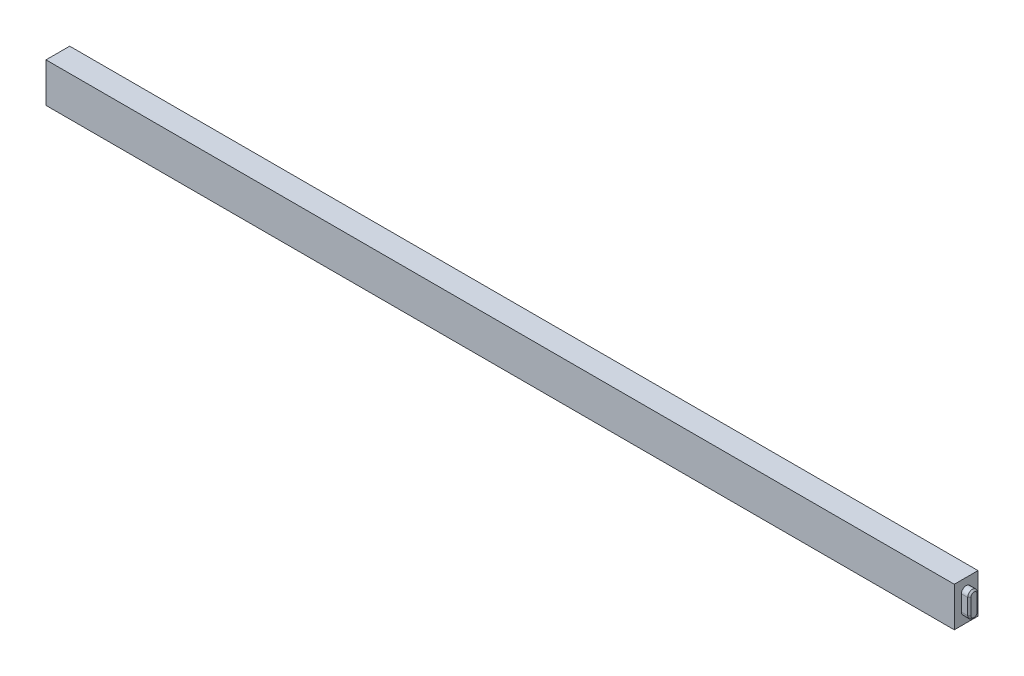
ISO-10303-21;
HEADER;
FILE_DESCRIPTION(('STEP AP214'),'2;1');
FILE_NAME('part.step','',(''),(''),'','','');
FILE_SCHEMA(('AUTOMOTIVE_DESIGN { 1 0 10303 214 1 1 1 1 }'));
ENDSEC;
DATA;
#1=APPLICATION_CONTEXT('core data for automotive mechanical design processes');
#2=APPLICATION_PROTOCOL_DEFINITION('international standard','automotive_design',2000,#1);
#3=PRODUCT_CONTEXT('',#1,'mechanical');
#4=PRODUCT('Part','Part','',(#3));
#5=PRODUCT_RELATED_PRODUCT_CATEGORY('part','',(#4));
#6=PRODUCT_DEFINITION_FORMATION('','',#4);
#7=PRODUCT_DEFINITION_CONTEXT('part definition',#1,'design');
#8=PRODUCT_DEFINITION('design','',#6,#7);
#9=PRODUCT_DEFINITION_SHAPE('','',#8);
#10=(LENGTH_UNIT() NAMED_UNIT(*) SI_UNIT(.MILLI.,.METRE.));
#11=(NAMED_UNIT(*) PLANE_ANGLE_UNIT() SI_UNIT($,.RADIAN.));
#12=(NAMED_UNIT(*) SI_UNIT($,.STERADIAN.) SOLID_ANGLE_UNIT());
#13=UNCERTAINTY_MEASURE_WITH_UNIT(LENGTH_MEASURE(1.E-05),#10,'distance_accuracy_value','');
#14=(GEOMETRIC_REPRESENTATION_CONTEXT(3) GLOBAL_UNCERTAINTY_ASSIGNED_CONTEXT((#13)) GLOBAL_UNIT_ASSIGNED_CONTEXT((#10,
#11,#12)) REPRESENTATION_CONTEXT('',''));
#15=CARTESIAN_POINT('',(0.,0.,0.));
#16=DIRECTION('',(0.,0.,1.));
#17=DIRECTION('',(1.,0.,0.));
#18=AXIS2_PLACEMENT_3D('',#15,#16,#17);
#19=CARTESIAN_POINT('',(-575.,25.,30.));
#20=DIRECTION('',(1.,0.,0.));
#21=DIRECTION('',(0.,1.,0.));
#22=AXIS2_PLACEMENT_3D('',#19,#20,#21);
#23=PLANE('',#22);
#24=DIRECTION('',(0.,-1.,0.));
#25=VECTOR('',#24,1.);
#26=CARTESIAN_POINT('',(-575.,25.,0.));
#27=LINE('',#26,#25);
#28=CARTESIAN_POINT('',(-575.,25.,0.));
#29=VERTEX_POINT('',#28);
#30=CARTESIAN_POINT('',(-575.,-25.,0.));
#31=VERTEX_POINT('',#30);
#32=EDGE_CURVE('E219',#29,#31,#27,.T.);
#33=ORIENTED_EDGE('',*,*,#32,.T.);
#34=DIRECTION('',(0.,0.,-1.));
#35=VECTOR('',#34,1.);
#36=CARTESIAN_POINT('',(-575.,-25.,30.));
#37=LINE('',#36,#35);
#38=CARTESIAN_POINT('',(-575.,-25.,30.));
#39=VERTEX_POINT('',#38);
#40=EDGE_CURVE('E224',#39,#31,#37,.T.);
#41=ORIENTED_EDGE('',*,*,#40,.F.);
#42=DIRECTION('',(0.,-1.,0.));
#43=VECTOR('',#42,1.);
#44=CARTESIAN_POINT('',(-575.,25.,30.));
#45=LINE('',#44,#43);
#46=CARTESIAN_POINT('',(-575.,25.,30.));
#47=VERTEX_POINT('',#46);
#48=EDGE_CURVE('E210',#47,#39,#45,.T.);
#49=ORIENTED_EDGE('',*,*,#48,.F.);
#50=DIRECTION('',(0.,0.,-1.));
#51=VECTOR('',#50,1.);
#52=CARTESIAN_POINT('',(-575.,25.,30.));
#53=LINE('',#52,#51);
#54=EDGE_CURVE('E227',#47,#29,#53,.T.);
#55=ORIENTED_EDGE('',*,*,#54,.T.);
#56=EDGE_LOOP('',(#33,#41,#49,#55));
#57=FACE_BOUND('',#56,.T.);
#58=CARTESIAN_POINT('',(-575.,9.99999999999997,15.));
#59=DIRECTION('',(-1.,0.,0.));
#60=DIRECTION('',(0.,-1.,0.));
#61=AXIS2_PLACEMENT_3D('',#58,#59,#60);
#62=CIRCLE('',#61,6.);
#63=CARTESIAN_POINT('',(-575.,9.99999999999997,21.));
#64=VERTEX_POINT('',#63);
#65=CARTESIAN_POINT('',(-575.,9.99999999999997,9.));
#66=VERTEX_POINT('',#65);
#67=EDGE_CURVE('E172',#64,#66,#62,.T.);
#68=ORIENTED_EDGE('',*,*,#67,.F.);
#69=DIRECTION('',(0.,-1.,0.));
#70=VECTOR('',#69,1.);
#71=CARTESIAN_POINT('',(-575.,9.99999999999997,21.));
#72=LINE('',#71,#70);
#73=CARTESIAN_POINT('',(-575.,-10.,21.));
#74=VERTEX_POINT('',#73);
#75=EDGE_CURVE('E169',#64,#74,#72,.T.);
#76=ORIENTED_EDGE('',*,*,#75,.T.);
#77=CARTESIAN_POINT('',(-575.,-10.,15.));
#78=DIRECTION('',(-1.,0.,0.));
#79=DIRECTION('',(0.,-1.,0.));
#80=AXIS2_PLACEMENT_3D('',#77,#78,#79);
#81=CIRCLE('',#80,6.);
#82=CARTESIAN_POINT('',(-575.,-10.,9.00000000000001));
#83=VERTEX_POINT('',#82);
#84=EDGE_CURVE('E157',#83,#74,#81,.T.);
#85=ORIENTED_EDGE('',*,*,#84,.F.);
#86=DIRECTION('',(0.,-1.,0.));
#87=VECTOR('',#86,1.);
#88=CARTESIAN_POINT('',(-575.,9.99999999999997,9.));
#89=LINE('',#88,#87);
#90=EDGE_CURVE('E166',#66,#83,#89,.T.);
#91=ORIENTED_EDGE('',*,*,#90,.F.);
#92=EDGE_LOOP('',(#68,#76,#85,#91));
#93=FACE_BOUND('',#92,.T.);
#94=ADVANCED_FACE('F41',(#57,#93),#23,.F.);
#95=CARTESIAN_POINT('',(575.,25.,30.));
#96=DIRECTION('',(-1.,0.,0.));
#97=DIRECTION('',(0.,-1.,0.));
#98=AXIS2_PLACEMENT_3D('',#95,#96,#97);
#99=PLANE('',#98);
#100=DIRECTION('',(0.,1.,0.));
#101=VECTOR('',#100,1.);
#102=CARTESIAN_POINT('',(575.,25.,0.));
#103=LINE('',#102,#101);
#104=CARTESIAN_POINT('',(575.,-25.,0.));
#105=VERTEX_POINT('',#104);
#106=CARTESIAN_POINT('',(575.,25.,0.));
#107=VERTEX_POINT('',#106);
#108=EDGE_CURVE('E203',#105,#107,#103,.T.);
#109=ORIENTED_EDGE('',*,*,#108,.T.);
#110=DIRECTION('',(0.,0.,-1.));
#111=VECTOR('',#110,1.);
#112=CARTESIAN_POINT('',(575.,25.,30.));
#113=LINE('',#112,#111);
#114=CARTESIAN_POINT('',(575.,25.,30.));
#115=VERTEX_POINT('',#114);
#116=EDGE_CURVE('E230',#115,#107,#113,.T.);
#117=ORIENTED_EDGE('',*,*,#116,.F.);
#118=DIRECTION('',(0.,1.,0.));
#119=VECTOR('',#118,1.);
#120=CARTESIAN_POINT('',(575.,25.,30.));
#121=LINE('',#120,#119);
#122=CARTESIAN_POINT('',(575.,-25.,30.));
#123=VERTEX_POINT('',#122);
#124=EDGE_CURVE('E204',#123,#115,#121,.T.);
#125=ORIENTED_EDGE('',*,*,#124,.F.);
#126=DIRECTION('',(0.,0.,-1.));
#127=VECTOR('',#126,1.);
#128=CARTESIAN_POINT('',(575.,-25.,30.));
#129=LINE('',#128,#127);
#130=EDGE_CURVE('E214',#123,#105,#129,.T.);
#131=ORIENTED_EDGE('',*,*,#130,.T.);
#132=EDGE_LOOP('',(#109,#117,#125,#131));
#133=FACE_BOUND('',#132,.T.);
#134=CARTESIAN_POINT('',(575.,10.,15.));
#135=DIRECTION('',(1.,0.,0.));
#136=DIRECTION('',(0.,0.,-1.));
#137=AXIS2_PLACEMENT_3D('',#134,#135,#136);
#138=CIRCLE('',#137,5.99999999999999);
#139=CARTESIAN_POINT('',(575.,10.,9.00000000000001));
#140=VERTEX_POINT('',#139);
#141=CARTESIAN_POINT('',(575.,10.,21.));
#142=VERTEX_POINT('',#141);
#143=EDGE_CURVE('E182',#140,#142,#138,.T.);
#144=ORIENTED_EDGE('',*,*,#143,.F.);
#145=DIRECTION('',(0.,1.,0.));
#146=VECTOR('',#145,1.);
#147=CARTESIAN_POINT('',(575.,10.,9.00000000000001));
#148=LINE('',#147,#146);
#149=CARTESIAN_POINT('',(575.,-10.,9.));
#150=VERTEX_POINT('',#149);
#151=EDGE_CURVE('E192',#150,#140,#148,.T.);
#152=ORIENTED_EDGE('',*,*,#151,.F.);
#153=CARTESIAN_POINT('',(575.,-10.,15.));
#154=DIRECTION('',(1.,0.,0.));
#155=DIRECTION('',(0.,0.,-1.));
#156=AXIS2_PLACEMENT_3D('',#153,#154,#155);
#157=CIRCLE('',#156,5.99999999999999);
#158=CARTESIAN_POINT('',(575.,-10.,21.));
#159=VERTEX_POINT('',#158);
#160=EDGE_CURVE('E189',#159,#150,#157,.T.);
#161=ORIENTED_EDGE('',*,*,#160,.F.);
#162=DIRECTION('',(0.,-1.,0.));
#163=VECTOR('',#162,1.);
#164=CARTESIAN_POINT('',(575.,10.,21.));
#165=LINE('',#164,#163);
#166=EDGE_CURVE('E185',#142,#159,#165,.T.);
#167=ORIENTED_EDGE('',*,*,#166,.F.);
#168=EDGE_LOOP('',(#144,#152,#161,#167));
#169=FACE_BOUND('',#168,.T.);
#170=ADVANCED_FACE('F316',(#133,#169),#99,.F.);
#171=CARTESIAN_POINT('',(-575.,25.,30.));
#172=DIRECTION('',(0.,-1.,0.));
#173=DIRECTION('',(0.,0.,-1.));
#174=AXIS2_PLACEMENT_3D('',#171,#172,#173);
#175=PLANE('',#174);
#176=DIRECTION('',(-1.,0.,0.));
#177=VECTOR('',#176,1.);
#178=CARTESIAN_POINT('',(-575.,25.,0.));
#179=LINE('',#178,#177);
#180=EDGE_CURVE('E217',#107,#29,#179,.T.);
#181=ORIENTED_EDGE('',*,*,#180,.T.);
#182=ORIENTED_EDGE('',*,*,#54,.F.);
#183=DIRECTION('',(-1.,0.,0.));
#184=VECTOR('',#183,1.);
#185=CARTESIAN_POINT('',(-575.,25.,30.));
#186=LINE('',#185,#184);
#187=EDGE_CURVE('E207',#115,#47,#186,.T.);
#188=ORIENTED_EDGE('',*,*,#187,.F.);
#189=ORIENTED_EDGE('',*,*,#116,.T.);
#190=EDGE_LOOP('',(#181,#182,#188,#189));
#191=FACE_BOUND('',#190,.T.);
#192=ADVANCED_FACE('F322',(#191),#175,.F.);
#193=CARTESIAN_POINT('',(-575.,-25.,30.));
#194=DIRECTION('',(0.,1.,0.));
#195=DIRECTION('',(0.,0.,1.));
#196=AXIS2_PLACEMENT_3D('',#193,#194,#195);
#197=PLANE('',#196);
#198=DIRECTION('',(1.,0.,0.));
#199=VECTOR('',#198,1.);
#200=CARTESIAN_POINT('',(-575.,-25.,0.));
#201=LINE('',#200,#199);
#202=EDGE_CURVE('E208',#31,#105,#201,.T.);
#203=ORIENTED_EDGE('',*,*,#202,.T.);
#204=ORIENTED_EDGE('',*,*,#130,.F.);
#205=DIRECTION('',(1.,0.,0.));
#206=VECTOR('',#205,1.);
#207=CARTESIAN_POINT('',(-575.,-25.,30.));
#208=LINE('',#207,#206);
#209=EDGE_CURVE('E212',#39,#123,#208,.T.);
#210=ORIENTED_EDGE('',*,*,#209,.F.);
#211=ORIENTED_EDGE('',*,*,#40,.T.);
#212=EDGE_LOOP('',(#203,#204,#210,#211));
#213=FACE_BOUND('',#212,.T.);
#214=ADVANCED_FACE('F327',(#213),#197,.F.);
#215=CARTESIAN_POINT('',(0.,0.,30.));
#216=DIRECTION('',(0.,0.,1.));
#217=DIRECTION('',(1.,0.,0.));
#218=AXIS2_PLACEMENT_3D('',#215,#216,#217);
#219=PLANE('',#218);
#220=ORIENTED_EDGE('',*,*,#124,.T.);
#221=ORIENTED_EDGE('',*,*,#187,.T.);
#222=ORIENTED_EDGE('',*,*,#48,.T.);
#223=ORIENTED_EDGE('',*,*,#209,.T.);
#224=EDGE_LOOP('',(#220,#221,#222,#223));
#225=FACE_BOUND('',#224,.T.);
#226=ADVANCED_FACE('F476',(#225),#219,.T.);
#227=CARTESIAN_POINT('',(0.,0.,0.));
#228=DIRECTION('',(0.,0.,1.));
#229=DIRECTION('',(1.,0.,0.));
#230=AXIS2_PLACEMENT_3D('',#227,#228,#229);
#231=PLANE('',#230);
#232=ORIENTED_EDGE('',*,*,#108,.F.);
#233=ORIENTED_EDGE('',*,*,#202,.F.);
#234=ORIENTED_EDGE('',*,*,#32,.F.);
#235=ORIENTED_EDGE('',*,*,#180,.F.);
#236=EDGE_LOOP('',(#232,#233,#234,#235));
#237=FACE_BOUND('',#236,.T.);
#238=ADVANCED_FACE('F464',(#237),#231,.F.);
#239=CARTESIAN_POINT('',(585.,10.,15.));
#240=DIRECTION('',(-1.,0.,0.));
#241=DIRECTION('',(0.,0.,1.));
#242=AXIS2_PLACEMENT_3D('',#239,#240,#241);
#243=CYLINDRICAL_SURFACE('',#242,5.99999999999999);
#244=DIRECTION('',(-1.,0.,0.));
#245=VECTOR('',#244,1.);
#246=CARTESIAN_POINT('',(585.,10.,21.));
#247=LINE('',#246,#245);
#248=CARTESIAN_POINT('',(583.,10.,21.));
#249=VERTEX_POINT('',#248);
#250=EDGE_CURVE('E201',#249,#142,#247,.T.);
#251=ORIENTED_EDGE('',*,*,#250,.F.);
#252=CARTESIAN_POINT('',(583.,10.,15.));
#253=DIRECTION('',(1.,0.,0.));
#254=DIRECTION('',(0.,0.,-1.));
#255=AXIS2_PLACEMENT_3D('',#252,#253,#254);
#256=CIRCLE('',#255,5.99999999999999);
#257=CARTESIAN_POINT('',(583.,10.,9.00000000000001));
#258=VERTEX_POINT('',#257);
#259=EDGE_CURVE('E249',#249,#258,#256,.F.);
#260=ORIENTED_EDGE('',*,*,#259,.T.);
#261=DIRECTION('',(-1.,0.,0.));
#262=VECTOR('',#261,1.);
#263=CARTESIAN_POINT('',(585.,10.,9.00000000000001));
#264=LINE('',#263,#262);
#265=EDGE_CURVE('E195',#258,#140,#264,.T.);
#266=ORIENTED_EDGE('',*,*,#265,.T.);
#267=ORIENTED_EDGE('',*,*,#143,.T.);
#268=EDGE_LOOP('',(#251,#260,#266,#267));
#269=FACE_BOUND('',#268,.T.);
#270=ADVANCED_FACE('F456',(#269),#243,.T.);
#271=CARTESIAN_POINT('',(585.,10.,21.));
#272=DIRECTION('',(0.,0.,-1.));
#273=DIRECTION('',(0.,1.,0.));
#274=AXIS2_PLACEMENT_3D('',#271,#272,#273);
#275=PLANE('',#274);
#276=DIRECTION('',(-1.,0.,0.));
#277=VECTOR('',#276,1.);
#278=CARTESIAN_POINT('',(585.,-10.,21.));
#279=LINE('',#278,#277);
#280=CARTESIAN_POINT('',(583.,-10.,21.));
#281=VERTEX_POINT('',#280);
#282=EDGE_CURVE('E199',#281,#159,#279,.T.);
#283=ORIENTED_EDGE('',*,*,#282,.F.);
#284=DIRECTION('',(0.,1.,0.));
#285=VECTOR('',#284,1.);
#286=CARTESIAN_POINT('',(583.,10.,21.));
#287=LINE('',#286,#285);
#288=EDGE_CURVE('E247',#281,#249,#287,.T.);
#289=ORIENTED_EDGE('',*,*,#288,.T.);
#290=ORIENTED_EDGE('',*,*,#250,.T.);
#291=ORIENTED_EDGE('',*,*,#166,.T.);
#292=EDGE_LOOP('',(#283,#289,#290,#291));
#293=FACE_BOUND('',#292,.T.);
#294=ADVANCED_FACE('F448',(#293),#275,.F.);
#295=CARTESIAN_POINT('',(585.,-10.,15.));
#296=DIRECTION('',(-1.,0.,0.));
#297=DIRECTION('',(0.,0.,1.));
#298=AXIS2_PLACEMENT_3D('',#295,#296,#297);
#299=CYLINDRICAL_SURFACE('',#298,5.99999999999999);
#300=DIRECTION('',(-1.,0.,0.));
#301=VECTOR('',#300,1.);
#302=CARTESIAN_POINT('',(585.,-10.,9.));
#303=LINE('',#302,#301);
#304=CARTESIAN_POINT('',(583.,-10.,9.));
#305=VERTEX_POINT('',#304);
#306=EDGE_CURVE('E197',#305,#150,#303,.T.);
#307=ORIENTED_EDGE('',*,*,#306,.F.);
#308=CARTESIAN_POINT('',(583.,-10.,15.));
#309=DIRECTION('',(1.,0.,0.));
#310=DIRECTION('',(0.,0.,-1.));
#311=AXIS2_PLACEMENT_3D('',#308,#309,#310);
#312=CIRCLE('',#311,5.99999999999999);
#313=EDGE_CURVE('E245',#305,#281,#312,.F.);
#314=ORIENTED_EDGE('',*,*,#313,.T.);
#315=ORIENTED_EDGE('',*,*,#282,.T.);
#316=ORIENTED_EDGE('',*,*,#160,.T.);
#317=EDGE_LOOP('',(#307,#314,#315,#316));
#318=FACE_BOUND('',#317,.T.);
#319=ADVANCED_FACE('F440',(#318),#299,.T.);
#320=CARTESIAN_POINT('',(585.,10.,9.00000000000001));
#321=DIRECTION('',(0.,0.,1.));
#322=DIRECTION('',(0.,-1.,0.));
#323=AXIS2_PLACEMENT_3D('',#320,#321,#322);
#324=PLANE('',#323);
#325=ORIENTED_EDGE('',*,*,#265,.F.);
#326=DIRECTION('',(0.,-1.,0.));
#327=VECTOR('',#326,1.);
#328=CARTESIAN_POINT('',(583.,-10.,9.));
#329=LINE('',#328,#327);
#330=EDGE_CURVE('E242',#258,#305,#329,.T.);
#331=ORIENTED_EDGE('',*,*,#330,.T.);
#332=ORIENTED_EDGE('',*,*,#306,.T.);
#333=ORIENTED_EDGE('',*,*,#151,.T.);
#334=EDGE_LOOP('',(#325,#331,#332,#333));
#335=FACE_BOUND('',#334,.T.);
#336=ADVANCED_FACE('F433',(#335),#324,.F.);
#337=CARTESIAN_POINT('',(585.,10.,15.));
#338=DIRECTION('',(1.,0.,0.));
#339=DIRECTION('',(0.,0.,-1.));
#340=AXIS2_PLACEMENT_3D('',#337,#338,#339);
#341=PLANE('',#340);
#342=CARTESIAN_POINT('',(585.,-10.,15.));
#343=DIRECTION('',(1.,0.,0.));
#344=DIRECTION('',(0.,0.,-1.));
#345=AXIS2_PLACEMENT_3D('',#342,#343,#344);
#346=CIRCLE('',#345,4.);
#347=CARTESIAN_POINT('',(585.,-10.,19.));
#348=VERTEX_POINT('',#347);
#349=CARTESIAN_POINT('',(585.,-10.,11.));
#350=VERTEX_POINT('',#349);
#351=EDGE_CURVE('E237',#348,#350,#346,.T.);
#352=ORIENTED_EDGE('',*,*,#351,.T.);
#353=DIRECTION('',(0.,1.,0.));
#354=VECTOR('',#353,1.);
#355=CARTESIAN_POINT('',(585.,10.,11.));
#356=LINE('',#355,#354);
#357=CARTESIAN_POINT('',(585.,10.,11.));
#358=VERTEX_POINT('',#357);
#359=EDGE_CURVE('E239',#350,#358,#356,.T.);
#360=ORIENTED_EDGE('',*,*,#359,.T.);
#361=CARTESIAN_POINT('',(585.,10.,15.));
#362=DIRECTION('',(1.,0.,0.));
#363=DIRECTION('',(0.,0.,-1.));
#364=AXIS2_PLACEMENT_3D('',#361,#362,#363);
#365=CIRCLE('',#364,4.);
#366=CARTESIAN_POINT('',(585.,10.,19.));
#367=VERTEX_POINT('',#366);
#368=EDGE_CURVE('E233',#358,#367,#365,.T.);
#369=ORIENTED_EDGE('',*,*,#368,.T.);
#370=DIRECTION('',(0.,-1.,0.));
#371=VECTOR('',#370,1.);
#372=CARTESIAN_POINT('',(585.,-10.,19.));
#373=LINE('',#372,#371);
#374=EDGE_CURVE('E235',#367,#348,#373,.T.);
#375=ORIENTED_EDGE('',*,*,#374,.T.);
#376=EDGE_LOOP('',(#352,#360,#369,#375));
#377=FACE_BOUND('',#376,.T.);
#378=ADVANCED_FACE('F354',(#377),#341,.T.);
#379=CARTESIAN_POINT('',(585.,10.,19.));
#380=DIRECTION('',(0.707106781186546,0.,0.707106781186549));
#381=DIRECTION('',(0.,1.,0.));
#382=AXIS2_PLACEMENT_3D('',#379,#380,#381);
#383=PLANE('',#382);
#384=DIRECTION('',(0.707106781186549,0.,-0.707106781186546));
#385=VECTOR('',#384,1.);
#386=CARTESIAN_POINT('',(583.,10.,21.));
#387=LINE('',#386,#385);
#388=EDGE_CURVE('E255',#249,#367,#387,.T.);
#389=ORIENTED_EDGE('',*,*,#388,.F.);
#390=ORIENTED_EDGE('',*,*,#288,.F.);
#391=DIRECTION('',(-0.707106781186549,0.,0.707106781186546));
#392=VECTOR('',#391,1.);
#393=CARTESIAN_POINT('',(585.,-10.,19.));
#394=LINE('',#393,#392);
#395=EDGE_CURVE('E186',#348,#281,#394,.T.);
#396=ORIENTED_EDGE('',*,*,#395,.F.);
#397=ORIENTED_EDGE('',*,*,#374,.F.);
#398=EDGE_LOOP('',(#389,#390,#396,#397));
#399=FACE_BOUND('',#398,.T.);
#400=ADVANCED_FACE('F348',(#399),#383,.T.);
#401=CARTESIAN_POINT('',(585.,-10.,15.));
#402=DIRECTION('',(-1.,0.,0.));
#403=DIRECTION('',(0.,0.,1.));
#404=AXIS2_PLACEMENT_3D('',#401,#402,#403);
#405=CONICAL_SURFACE('',#404,4.,0.785398163397446);
#406=ORIENTED_EDGE('',*,*,#395,.T.);
#407=ORIENTED_EDGE('',*,*,#313,.F.);
#408=DIRECTION('',(-0.707106781186549,0.,-0.707106781186546));
#409=VECTOR('',#408,1.);
#410=CARTESIAN_POINT('',(585.,-10.,11.));
#411=LINE('',#410,#409);
#412=EDGE_CURVE('E253',#350,#305,#411,.T.);
#413=ORIENTED_EDGE('',*,*,#412,.F.);
#414=ORIENTED_EDGE('',*,*,#351,.F.);
#415=EDGE_LOOP('',(#406,#407,#413,#414));
#416=FACE_BOUND('',#415,.T.);
#417=ADVANCED_FACE('F341',(#416),#405,.T.);
#418=CARTESIAN_POINT('',(585.,10.,15.));
#419=DIRECTION('',(-1.,0.,0.));
#420=DIRECTION('',(0.,0.,1.));
#421=AXIS2_PLACEMENT_3D('',#418,#419,#420);
#422=CONICAL_SURFACE('',#421,4.,0.785398163397446);
#423=ORIENTED_EDGE('',*,*,#388,.T.);
#424=ORIENTED_EDGE('',*,*,#368,.F.);
#425=DIRECTION('',(0.707106781186549,0.,0.707106781186546));
#426=VECTOR('',#425,1.);
#427=CARTESIAN_POINT('',(583.,10.,9.00000000000001));
#428=LINE('',#427,#426);
#429=EDGE_CURVE('E181',#258,#358,#428,.T.);
#430=ORIENTED_EDGE('',*,*,#429,.F.);
#431=ORIENTED_EDGE('',*,*,#259,.F.);
#432=EDGE_LOOP('',(#423,#424,#430,#431));
#433=FACE_BOUND('',#432,.T.);
#434=ADVANCED_FACE('F312',(#433),#422,.T.);
#435=CARTESIAN_POINT('',(585.,10.,11.));
#436=DIRECTION('',(0.707106781186546,0.,-0.707106781186549));
#437=DIRECTION('',(0.,-1.,0.));
#438=AXIS2_PLACEMENT_3D('',#435,#436,#437);
#439=PLANE('',#438);
#440=ORIENTED_EDGE('',*,*,#412,.T.);
#441=ORIENTED_EDGE('',*,*,#330,.F.);
#442=ORIENTED_EDGE('',*,*,#429,.T.);
#443=ORIENTED_EDGE('',*,*,#359,.F.);
#444=EDGE_LOOP('',(#440,#441,#442,#443));
#445=FACE_BOUND('',#444,.T.);
#446=ADVANCED_FACE('F304',(#445),#439,.T.);
#447=CARTESIAN_POINT('',(-585.,9.99999999999998,15.));
#448=DIRECTION('',(1.,0.,0.));
#449=DIRECTION('',(0.,1.,0.));
#450=AXIS2_PLACEMENT_3D('',#447,#448,#449);
#451=CYLINDRICAL_SURFACE('',#450,6.);
#452=DIRECTION('',(1.,0.,0.));
#453=VECTOR('',#452,1.);
#454=CARTESIAN_POINT('',(-585.,9.99999999999998,9.));
#455=LINE('',#454,#453);
#456=CARTESIAN_POINT('',(-583.,9.99999999999998,9.));
#457=VERTEX_POINT('',#456);
#458=EDGE_CURVE('E159',#457,#66,#455,.T.);
#459=ORIENTED_EDGE('',*,*,#458,.F.);
#460=CARTESIAN_POINT('',(-583.,9.99999999999998,15.));
#461=DIRECTION('',(-1.,0.,0.));
#462=DIRECTION('',(0.,-1.,0.));
#463=AXIS2_PLACEMENT_3D('',#460,#461,#462);
#464=CIRCLE('',#463,6.);
#465=CARTESIAN_POINT('',(-583.,9.99999999999998,21.));
#466=VERTEX_POINT('',#465);
#467=EDGE_CURVE('E11',#457,#466,#464,.F.);
#468=ORIENTED_EDGE('',*,*,#467,.T.);
#469=DIRECTION('',(1.,0.,0.));
#470=VECTOR('',#469,1.);
#471=CARTESIAN_POINT('',(-585.,9.99999999999998,21.));
#472=LINE('',#471,#470);
#473=EDGE_CURVE('E177',#466,#64,#472,.T.);
#474=ORIENTED_EDGE('',*,*,#473,.T.);
#475=ORIENTED_EDGE('',*,*,#67,.T.);
#476=EDGE_LOOP('',(#459,#468,#474,#475));
#477=FACE_BOUND('',#476,.T.);
#478=ADVANCED_FACE('F302',(#477),#451,.T.);
#479=CARTESIAN_POINT('',(-585.,9.99999999999998,9.));
#480=DIRECTION('',(0.,0.,1.));
#481=DIRECTION('',(0.,-1.,0.));
#482=AXIS2_PLACEMENT_3D('',#479,#480,#481);
#483=PLANE('',#482);
#484=DIRECTION('',(1.,0.,0.));
#485=VECTOR('',#484,1.);
#486=CARTESIAN_POINT('',(-585.,-10.,9.00000000000001));
#487=LINE('',#486,#485);
#488=CARTESIAN_POINT('',(-583.,-10.,9.00000000000001));
#489=VERTEX_POINT('',#488);
#490=EDGE_CURVE('E154',#489,#83,#487,.T.);
#491=ORIENTED_EDGE('',*,*,#490,.F.);
#492=DIRECTION('',(0.,1.,0.));
#493=VECTOR('',#492,1.);
#494=CARTESIAN_POINT('',(-583.,9.99999999999998,9.));
#495=LINE('',#494,#493);
#496=EDGE_CURVE('E51',#489,#457,#495,.T.);
#497=ORIENTED_EDGE('',*,*,#496,.T.);
#498=ORIENTED_EDGE('',*,*,#458,.T.);
#499=ORIENTED_EDGE('',*,*,#90,.T.);
#500=EDGE_LOOP('',(#491,#497,#498,#499));
#501=FACE_BOUND('',#500,.T.);
#502=ADVANCED_FACE('F171',(#501),#483,.F.);
#503=CARTESIAN_POINT('',(-585.,-10.,15.));
#504=DIRECTION('',(1.,0.,0.));
#505=DIRECTION('',(0.,1.,0.));
#506=AXIS2_PLACEMENT_3D('',#503,#504,#505);
#507=CYLINDRICAL_SURFACE('',#506,6.);
#508=DIRECTION('',(1.,0.,0.));
#509=VECTOR('',#508,1.);
#510=CARTESIAN_POINT('',(-585.,-10.,21.));
#511=LINE('',#510,#509);
#512=CARTESIAN_POINT('',(-583.,-10.,21.));
#513=VERTEX_POINT('',#512);
#514=EDGE_CURVE('E160',#513,#74,#511,.T.);
#515=ORIENTED_EDGE('',*,*,#514,.F.);
#516=CARTESIAN_POINT('',(-583.,-10.,15.));
#517=DIRECTION('',(-1.,0.,0.));
#518=DIRECTION('',(0.,-1.,0.));
#519=AXIS2_PLACEMENT_3D('',#516,#517,#518);
#520=CIRCLE('',#519,6.);
#521=EDGE_CURVE('E66',#513,#489,#520,.F.);
#522=ORIENTED_EDGE('',*,*,#521,.T.);
#523=ORIENTED_EDGE('',*,*,#490,.T.);
#524=ORIENTED_EDGE('',*,*,#84,.T.);
#525=EDGE_LOOP('',(#515,#522,#523,#524));
#526=FACE_BOUND('',#525,.T.);
#527=ADVANCED_FACE('F156',(#526),#507,.T.);
#528=CARTESIAN_POINT('',(-585.,9.99999999999998,21.));
#529=DIRECTION('',(0.,0.,1.));
#530=DIRECTION('',(0.,-1.,0.));
#531=AXIS2_PLACEMENT_3D('',#528,#529,#530);
#532=PLANE('',#531);
#533=ORIENTED_EDGE('',*,*,#473,.F.);
#534=DIRECTION('',(0.,-1.,0.));
#535=VECTOR('',#534,1.);
#536=CARTESIAN_POINT('',(-583.,9.99999999999998,21.));
#537=LINE('',#536,#535);
#538=EDGE_CURVE('E251',#466,#513,#537,.T.);
#539=ORIENTED_EDGE('',*,*,#538,.T.);
#540=ORIENTED_EDGE('',*,*,#514,.T.);
#541=ORIENTED_EDGE('',*,*,#75,.F.);
#542=EDGE_LOOP('',(#533,#539,#540,#541));
#543=FACE_BOUND('',#542,.T.);
#544=ADVANCED_FACE('F300',(#543),#532,.T.);
#545=CARTESIAN_POINT('',(-585.,9.99999999999998,15.));
#546=DIRECTION('',(-1.,0.,0.));
#547=DIRECTION('',(0.,-1.,0.));
#548=AXIS2_PLACEMENT_3D('',#545,#546,#547);
#549=PLANE('',#548);
#550=CARTESIAN_POINT('',(-585.,-10.,15.));
#551=DIRECTION('',(-1.,0.,0.));
#552=DIRECTION('',(0.,-1.,0.));
#553=AXIS2_PLACEMENT_3D('',#550,#551,#552);
#554=CIRCLE('',#553,4.0000000000001);
#555=CARTESIAN_POINT('',(-585.,-10.,10.9999999999999));
#556=VERTEX_POINT('',#555);
#557=CARTESIAN_POINT('',(-585.,-10.,19.0000000000001));
#558=VERTEX_POINT('',#557);
#559=EDGE_CURVE('E266',#556,#558,#554,.T.);
#560=ORIENTED_EDGE('',*,*,#559,.T.);
#561=DIRECTION('',(0.,1.,0.));
#562=VECTOR('',#561,1.);
#563=CARTESIAN_POINT('',(-585.,9.99999999999998,19.0000000000001));
#564=LINE('',#563,#562);
#565=CARTESIAN_POINT('',(-585.,9.99999999999998,19.0000000000001));
#566=VERTEX_POINT('',#565);
#567=EDGE_CURVE('E268',#558,#566,#564,.T.);
#568=ORIENTED_EDGE('',*,*,#567,.T.);
#569=CARTESIAN_POINT('',(-585.,9.99999999999998,15.));
#570=DIRECTION('',(-1.,0.,0.));
#571=DIRECTION('',(0.,-1.,0.));
#572=AXIS2_PLACEMENT_3D('',#569,#570,#571);
#573=CIRCLE('',#572,4.00000000000012);
#574=CARTESIAN_POINT('',(-585.,9.99999999999998,10.9999999999999));
#575=VERTEX_POINT('',#574);
#576=EDGE_CURVE('E262',#566,#575,#573,.T.);
#577=ORIENTED_EDGE('',*,*,#576,.T.);
#578=DIRECTION('',(0.,-1.,0.));
#579=VECTOR('',#578,1.);
#580=CARTESIAN_POINT('',(-585.,-10.,10.9999999999999));
#581=LINE('',#580,#579);
#582=EDGE_CURVE('E264',#575,#556,#581,.T.);
#583=ORIENTED_EDGE('',*,*,#582,.T.);
#584=EDGE_LOOP('',(#560,#568,#577,#583));
#585=FACE_BOUND('',#584,.T.);
#586=ADVANCED_FACE('F291',(#585),#549,.T.);
#587=CARTESIAN_POINT('',(-585.,9.99999999999998,10.9999999999999));
#588=DIRECTION('',(-0.707106781186545,0.,-0.70710678118655));
#589=DIRECTION('',(0.,1.,0.));
#590=AXIS2_PLACEMENT_3D('',#587,#588,#589);
#591=PLANE('',#590);
#592=DIRECTION('',(0.70710678118655,0.,-0.707106781186545));
#593=VECTOR('',#592,1.);
#594=CARTESIAN_POINT('',(-585.,-10.,10.9999999999999));
#595=LINE('',#594,#593);
#596=EDGE_CURVE('E276',#556,#489,#595,.T.);
#597=ORIENTED_EDGE('',*,*,#596,.F.);
#598=ORIENTED_EDGE('',*,*,#582,.F.);
#599=DIRECTION('',(-0.70710678118655,0.,0.707106781186545));
#600=VECTOR('',#599,1.);
#601=CARTESIAN_POINT('',(-583.,9.99999999999998,9.));
#602=LINE('',#601,#600);
#603=EDGE_CURVE('E46',#457,#575,#602,.T.);
#604=ORIENTED_EDGE('',*,*,#603,.F.);
#605=ORIENTED_EDGE('',*,*,#496,.F.);
#606=EDGE_LOOP('',(#597,#598,#604,#605));
#607=FACE_BOUND('',#606,.T.);
#608=ADVANCED_FACE('F44',(#607),#591,.T.);
#609=CARTESIAN_POINT('',(-585.,9.99999999999998,15.));
#610=DIRECTION('',(1.,0.,0.));
#611=DIRECTION('',(0.,1.,0.));
#612=AXIS2_PLACEMENT_3D('',#609,#610,#611);
#613=CONICAL_SURFACE('',#612,4.00000000000012,0.785398163397445);
#614=ORIENTED_EDGE('',*,*,#603,.T.);
#615=ORIENTED_EDGE('',*,*,#576,.F.);
#616=DIRECTION('',(-0.70710678118655,0.,-0.707106781186545));
#617=VECTOR('',#616,1.);
#618=CARTESIAN_POINT('',(-583.,9.99999999999998,21.));
#619=LINE('',#618,#617);
#620=EDGE_CURVE('E275',#466,#566,#619,.T.);
#621=ORIENTED_EDGE('',*,*,#620,.F.);
#622=ORIENTED_EDGE('',*,*,#467,.F.);
#623=EDGE_LOOP('',(#614,#615,#621,#622));
#624=FACE_BOUND('',#623,.T.);
#625=ADVANCED_FACE('F286',(#624),#613,.T.);
#626=CARTESIAN_POINT('',(-585.,-10.,15.));
#627=DIRECTION('',(1.,0.,0.));
#628=DIRECTION('',(0.,1.,0.));
#629=AXIS2_PLACEMENT_3D('',#626,#627,#628);
#630=CONICAL_SURFACE('',#629,4.00000000000012,0.785398163397445);
#631=ORIENTED_EDGE('',*,*,#596,.T.);
#632=ORIENTED_EDGE('',*,*,#521,.F.);
#633=DIRECTION('',(0.707106781186546,0.,0.707106781186549));
#634=VECTOR('',#633,1.);
#635=CARTESIAN_POINT('',(-585.,-10.,19.0000000000001));
#636=LINE('',#635,#634);
#637=EDGE_CURVE('E273',#558,#513,#636,.T.);
#638=ORIENTED_EDGE('',*,*,#637,.F.);
#639=ORIENTED_EDGE('',*,*,#559,.F.);
#640=EDGE_LOOP('',(#631,#632,#638,#639));
#641=FACE_BOUND('',#640,.T.);
#642=ADVANCED_FACE('F297',(#641),#630,.T.);
#643=CARTESIAN_POINT('',(-583.,9.99999999999998,21.));
#644=DIRECTION('',(0.707106781186545,0.,-0.70710678118655));
#645=DIRECTION('',(0.,-1.,0.));
#646=AXIS2_PLACEMENT_3D('',#643,#644,#645);
#647=PLANE('',#646);
#648=ORIENTED_EDGE('',*,*,#620,.T.);
#649=ORIENTED_EDGE('',*,*,#567,.F.);
#650=ORIENTED_EDGE('',*,*,#637,.T.);
#651=ORIENTED_EDGE('',*,*,#538,.F.);
#652=EDGE_LOOP('',(#648,#649,#650,#651));
#653=FACE_BOUND('',#652,.T.);
#654=ADVANCED_FACE('F295',(#653),#647,.F.);
#655=CLOSED_SHELL('',(#94,#170,#192,#214,#226,#238,#270,#294,#319,#336,#378,#400,#417,#434,#446,
#478,#502,#527,#544,#586,#608,#625,#642,#654));
#656=MANIFOLD_SOLID_BREP('B2',#655);
#657=ADVANCED_BREP_SHAPE_REPRESENTATION('',(#18,#656),#14);
#658=SHAPE_DEFINITION_REPRESENTATION(#9,#657);
ENDSEC;
END-ISO-10303-21;
